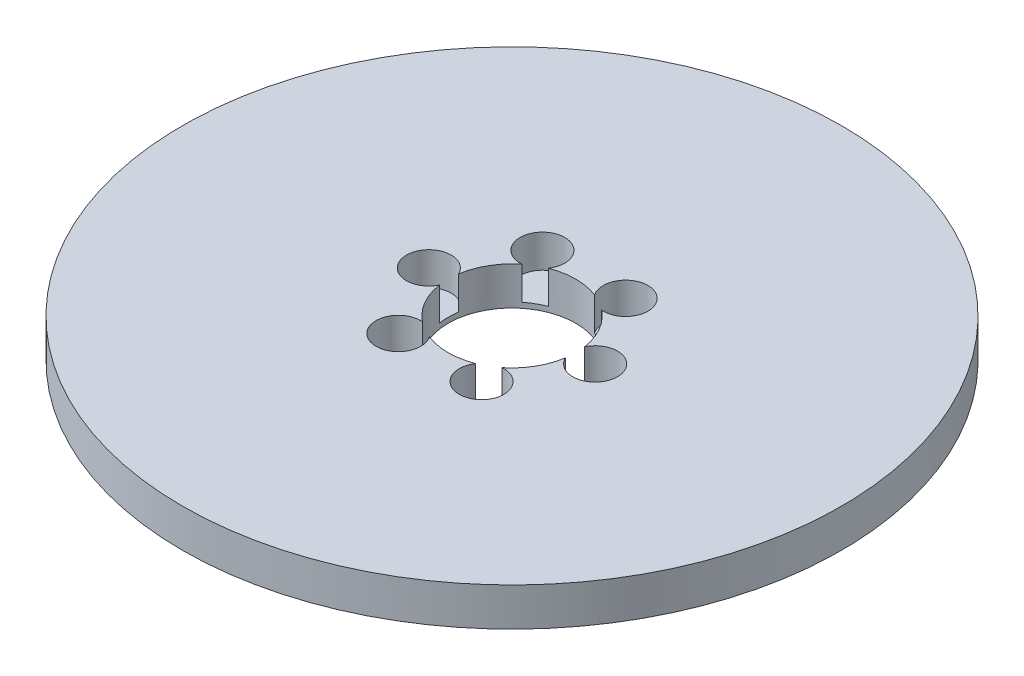
ISO-10303-21;
HEADER;
FILE_DESCRIPTION(('STEP AP214'),'2;1');
FILE_NAME('part.step','',(''),(''),'','','');
FILE_SCHEMA(('AUTOMOTIVE_DESIGN { 1 0 10303 214 1 1 1 1 }'));
ENDSEC;
DATA;
#1=APPLICATION_CONTEXT('core data for automotive mechanical design processes');
#2=APPLICATION_PROTOCOL_DEFINITION('international standard','automotive_design',2000,#1);
#3=PRODUCT_CONTEXT('',#1,'mechanical');
#4=PRODUCT('Part','Part','',(#3));
#5=PRODUCT_RELATED_PRODUCT_CATEGORY('part','',(#4));
#6=PRODUCT_DEFINITION_FORMATION('','',#4);
#7=PRODUCT_DEFINITION_CONTEXT('part definition',#1,'design');
#8=PRODUCT_DEFINITION('design','',#6,#7);
#9=PRODUCT_DEFINITION_SHAPE('','',#8);
#10=(LENGTH_UNIT() NAMED_UNIT(*) SI_UNIT(.MILLI.,.METRE.));
#11=(NAMED_UNIT(*) PLANE_ANGLE_UNIT() SI_UNIT($,.RADIAN.));
#12=(NAMED_UNIT(*) SI_UNIT($,.STERADIAN.) SOLID_ANGLE_UNIT());
#13=UNCERTAINTY_MEASURE_WITH_UNIT(LENGTH_MEASURE(1.E-05),#10,'distance_accuracy_value','');
#14=(GEOMETRIC_REPRESENTATION_CONTEXT(3) GLOBAL_UNCERTAINTY_ASSIGNED_CONTEXT((#13)) GLOBAL_UNIT_ASSIGNED_CONTEXT((#10,
#11,#12)) REPRESENTATION_CONTEXT('',''));
#15=CARTESIAN_POINT('',(0.,0.,0.));
#16=DIRECTION('',(0.,0.,1.));
#17=DIRECTION('',(1.,0.,0.));
#18=AXIS2_PLACEMENT_3D('',#15,#16,#17);
#19=CARTESIAN_POINT('',(0.,9.,0.));
#20=DIRECTION('',(0.,-1.,0.));
#21=DIRECTION('',(0.,0.,-1.));
#22=AXIS2_PLACEMENT_3D('',#19,#20,#21);
#23=CYLINDRICAL_SURFACE('',#22,77.5);
#24=CARTESIAN_POINT('',(0.,9.,0.));
#25=DIRECTION('',(0.,1.,0.));
#26=DIRECTION('',(0.,0.,1.));
#27=AXIS2_PLACEMENT_3D('',#24,#25,#26);
#28=CIRCLE('',#27,77.5);
#29=CARTESIAN_POINT('',(0.,9.,77.5));
#30=VERTEX_POINT('',#29);
#31=EDGE_CURVE('E171',#30,#30,#28,.T.);
#32=ORIENTED_EDGE('',*,*,#31,.F.);
#33=EDGE_LOOP('',(#32));
#34=FACE_BOUND('',#33,.T.);
#35=CARTESIAN_POINT('',(0.,0.,0.));
#36=DIRECTION('',(0.,1.,0.));
#37=DIRECTION('',(0.,0.,1.));
#38=AXIS2_PLACEMENT_3D('',#35,#36,#37);
#39=CIRCLE('',#38,77.5);
#40=CARTESIAN_POINT('',(0.,0.,77.5));
#41=VERTEX_POINT('',#40);
#42=EDGE_CURVE('E157',#41,#41,#39,.T.);
#43=ORIENTED_EDGE('',*,*,#42,.T.);
#44=EDGE_LOOP('',(#43));
#45=FACE_BOUND('',#44,.T.);
#46=ADVANCED_FACE('F39',(#34,#45),#23,.T.);
#47=CARTESIAN_POINT('',(0.,9.,0.));
#48=DIRECTION('',(0.,1.,0.));
#49=DIRECTION('',(0.,0.,1.));
#50=AXIS2_PLACEMENT_3D('',#47,#48,#49);
#51=PLANE('',#50);
#52=CARTESIAN_POINT('',(-9.77904692339867,9.,-16.9378061209262));
#53=DIRECTION('',(0.,1.,0.));
#54=DIRECTION('',(-0.866025403784433,0.,0.50000000000001));
#55=AXIS2_PLACEMENT_3D('',#52,#53,#54);
#56=CIRCLE('',#55,5.24770905868507);
#57=CARTESIAN_POINT('',(-5.44702099483882,9.,-13.9760495949959));
#58=VERTEX_POINT('',#57);
#59=CARTESIAN_POINT('',(-9.38010349639853,9.,-11.7052833539753));
#60=VERTEX_POINT('',#59);
#61=EDGE_CURVE('E214',#58,#60,#56,.T.);
#62=ORIENTED_EDGE('',*,*,#61,.F.);
#63=CARTESIAN_POINT('',(0.,9.,0.));
#64=DIRECTION('',(0.,1.,0.));
#65=DIRECTION('',(0.,0.,1.));
#66=AXIS2_PLACEMENT_3D('',#63,#64,#65);
#67=CIRCLE('',#66,15.);
#68=CARTESIAN_POINT('',(5.44702099483852,9.,-13.976049594996));
#69=VERTEX_POINT('',#68);
#70=EDGE_CURVE('E272',#69,#58,#67,.T.);
#71=ORIENTED_EDGE('',*,*,#70,.F.);
#72=CARTESIAN_POINT('',(9.77904692339832,9.,-16.9378061209264));
#73=DIRECTION('',(0.,1.,0.));
#74=DIRECTION('',(-0.866025403784443,0.,-0.499999999999992));
#75=AXIS2_PLACEMENT_3D('',#72,#73,#74);
#76=CIRCLE('',#75,5.24770905868507);
#77=CARTESIAN_POINT('',(9.38010349639829,9.,-11.7052833539755));
#78=VERTEX_POINT('',#77);
#79=EDGE_CURVE('E285',#78,#69,#76,.T.);
#80=ORIENTED_EDGE('',*,*,#79,.F.);
#81=CARTESIAN_POINT('',(14.827124491237,9.,-2.27076624102052));
#82=VERTEX_POINT('',#81);
#83=EDGE_CURVE('E165',#82,#78,#67,.T.);
#84=ORIENTED_EDGE('',*,*,#83,.F.);
#85=CARTESIAN_POINT('',(19.558093846797,9.,0.));
#86=DIRECTION('',(0.,1.,0.));
#87=DIRECTION('',(0.,0.,-1.));
#88=AXIS2_PLACEMENT_3D('',#85,#86,#87);
#89=CIRCLE('',#88,5.24770905868507);
#90=CARTESIAN_POINT('',(14.827124491237,9.,2.27076624102052));
#91=VERTEX_POINT('',#90);
#92=EDGE_CURVE('E281',#91,#82,#89,.T.);
#93=ORIENTED_EDGE('',*,*,#92,.F.);
#94=CARTESIAN_POINT('',(9.38010349639845,9.,11.7052833539754));
#95=VERTEX_POINT('',#94);
#96=EDGE_CURVE('E160',#95,#91,#67,.T.);
#97=ORIENTED_EDGE('',*,*,#96,.F.);
#98=CARTESIAN_POINT('',(9.77904692339856,9.,16.9378061209262));
#99=DIRECTION('',(0.,1.,0.));
#100=DIRECTION('',(0.866025403784436,0.,-0.500000000000004));
#101=AXIS2_PLACEMENT_3D('',#98,#99,#100);
#102=CIRCLE('',#101,5.24770905868507);
#103=CARTESIAN_POINT('',(5.44702099483872,9.,13.9760495949959));
#104=VERTEX_POINT('',#103);
#105=EDGE_CURVE('E154',#104,#95,#102,.T.);
#106=ORIENTED_EDGE('',*,*,#105,.F.);
#107=CARTESIAN_POINT('',(-5.44702099483862,9.,13.976049594996));
#108=VERTEX_POINT('',#107);
#109=EDGE_CURVE('E150',#108,#104,#67,.T.);
#110=ORIENTED_EDGE('',*,*,#109,.F.);
#111=CARTESIAN_POINT('',(-9.77904692339844,9.,16.9378061209263));
#112=DIRECTION('',(0.,1.,0.));
#113=DIRECTION('',(0.86602540378444,0.,0.499999999999998));
#114=AXIS2_PLACEMENT_3D('',#111,#112,#113);
#115=CIRCLE('',#114,5.24770905868507);
#116=CARTESIAN_POINT('',(-9.38010349639837,9.,11.7052833539755));
#117=VERTEX_POINT('',#116);
#118=EDGE_CURVE('E127',#117,#108,#115,.T.);
#119=ORIENTED_EDGE('',*,*,#118,.F.);
#120=CARTESIAN_POINT('',(-14.827124491237,9.,2.27076624102052));
#121=VERTEX_POINT('',#120);
#122=EDGE_CURVE('E156',#121,#117,#67,.T.);
#123=ORIENTED_EDGE('',*,*,#122,.F.);
#124=CARTESIAN_POINT('',(-19.558093846797,9.,0.));
#125=DIRECTION('',(0.,1.,0.));
#126=DIRECTION('',(0.,0.,1.));
#127=AXIS2_PLACEMENT_3D('',#124,#125,#126);
#128=CIRCLE('',#127,5.24770905868507);
#129=CARTESIAN_POINT('',(-14.827124491237,9.,-2.27076624102052));
#130=VERTEX_POINT('',#129);
#131=EDGE_CURVE('E164',#130,#121,#128,.T.);
#132=ORIENTED_EDGE('',*,*,#131,.F.);
#133=EDGE_CURVE('E159',#60,#130,#67,.T.);
#134=ORIENTED_EDGE('',*,*,#133,.F.);
#135=EDGE_LOOP('',(#62,#71,#80,#84,#93,#97,#106,#110,#119,#123,#132,#134));
#136=FACE_BOUND('',#135,.T.);
#137=ORIENTED_EDGE('',*,*,#31,.T.);
#138=EDGE_LOOP('',(#137));
#139=FACE_BOUND('',#138,.T.);
#140=ADVANCED_FACE('F155',(#136,#139),#51,.T.);
#141=CARTESIAN_POINT('',(0.,0.,0.));
#142=DIRECTION('',(0.,1.,0.));
#143=DIRECTION('',(0.,0.,1.));
#144=AXIS2_PLACEMENT_3D('',#141,#142,#143);
#145=PLANE('',#144);
#146=CARTESIAN_POINT('',(0.,0.,0.));
#147=DIRECTION('',(0.,1.,0.));
#148=DIRECTION('',(0.,0.,1.));
#149=AXIS2_PLACEMENT_3D('',#146,#147,#148);
#150=CIRCLE('',#149,15.);
#151=CARTESIAN_POINT('',(0.,0.,15.));
#152=VERTEX_POINT('',#151);
#153=EDGE_CURVE('E170',#152,#152,#150,.T.);
#154=ORIENTED_EDGE('',*,*,#153,.T.);
#155=EDGE_LOOP('',(#154));
#156=FACE_BOUND('',#155,.T.);
#157=ORIENTED_EDGE('',*,*,#42,.F.);
#158=EDGE_LOOP('',(#157));
#159=FACE_BOUND('',#158,.T.);
#160=ADVANCED_FACE('F232',(#156,#159),#145,.F.);
#161=CARTESIAN_POINT('',(0.,9.,0.));
#162=DIRECTION('',(0.,-1.,0.));
#163=DIRECTION('',(0.,0.,-1.));
#164=AXIS2_PLACEMENT_3D('',#161,#162,#163);
#165=CYLINDRICAL_SURFACE('',#164,15.);
#166=DIRECTION('',(0.,1.,0.));
#167=VECTOR('',#166,1.);
#168=CARTESIAN_POINT('',(-5.44702099483882,5.12002690759225,-13.9760495949959));
#169=LINE('',#168,#167);
#170=CARTESIAN_POINT('',(-5.44702099483882,1.24005381518451,-13.9760495949959));
#171=VERTEX_POINT('',#170);
#172=EDGE_CURVE('E11',#171,#58,#169,.T.);
#173=ORIENTED_EDGE('',*,*,#172,.F.);
#174=CARTESIAN_POINT('',(0.,1.24005381518451,0.));
#175=DIRECTION('',(0.,1.,0.));
#176=DIRECTION('',(0.,0.,1.));
#177=AXIS2_PLACEMENT_3D('',#174,#175,#176);
#178=CIRCLE('',#177,15.);
#179=CARTESIAN_POINT('',(-9.38010349639853,1.24005381518451,-11.7052833539753));
#180=VERTEX_POINT('',#179);
#181=EDGE_CURVE('E209',#171,#180,#178,.T.);
#182=ORIENTED_EDGE('',*,*,#181,.T.);
#183=DIRECTION('',(0.,1.,0.));
#184=VECTOR('',#183,1.);
#185=CARTESIAN_POINT('',(-9.38010349639853,5.12002690759225,-11.7052833539753));
#186=LINE('',#185,#184);
#187=EDGE_CURVE('E46',#60,#180,#186,.F.);
#188=ORIENTED_EDGE('',*,*,#187,.F.);
#189=ORIENTED_EDGE('',*,*,#133,.T.);
#190=DIRECTION('',(0.,1.,0.));
#191=VECTOR('',#190,1.);
#192=CARTESIAN_POINT('',(-14.8271244912371,5.12002690759225,-2.27076624102053));
#193=LINE('',#192,#191);
#194=CARTESIAN_POINT('',(-14.827124491237,1.24005381518451,-2.27076624102052));
#195=VERTEX_POINT('',#194);
#196=EDGE_CURVE('E185',#195,#130,#193,.T.);
#197=ORIENTED_EDGE('',*,*,#196,.F.);
#198=CARTESIAN_POINT('',(0.,1.24005381518451,0.));
#199=DIRECTION('',(0.,1.,0.));
#200=DIRECTION('',(0.,0.,1.));
#201=AXIS2_PLACEMENT_3D('',#198,#199,#200);
#202=CIRCLE('',#201,15.);
#203=CARTESIAN_POINT('',(-14.827124491237,1.24005381518451,2.27076624102052));
#204=VERTEX_POINT('',#203);
#205=EDGE_CURVE('E173',#195,#204,#202,.T.);
#206=ORIENTED_EDGE('',*,*,#205,.T.);
#207=DIRECTION('',(0.,1.,0.));
#208=VECTOR('',#207,1.);
#209=CARTESIAN_POINT('',(-14.8271244912371,5.12002690759225,2.27076624102053));
#210=LINE('',#209,#208);
#211=EDGE_CURVE('E178',#121,#204,#210,.F.);
#212=ORIENTED_EDGE('',*,*,#211,.F.);
#213=ORIENTED_EDGE('',*,*,#122,.T.);
#214=DIRECTION('',(0.,1.,0.));
#215=VECTOR('',#214,1.);
#216=CARTESIAN_POINT('',(-9.38010349639837,5.12002690759225,11.7052833539755));
#217=LINE('',#216,#215);
#218=CARTESIAN_POINT('',(-9.38010349639837,1.24005381518451,11.7052833539755));
#219=VERTEX_POINT('',#218);
#220=EDGE_CURVE('E132',#219,#117,#217,.T.);
#221=ORIENTED_EDGE('',*,*,#220,.F.);
#222=CARTESIAN_POINT('',(0.,1.24005381518451,0.));
#223=DIRECTION('',(0.,1.,0.));
#224=DIRECTION('',(0.,0.,1.));
#225=AXIS2_PLACEMENT_3D('',#222,#223,#224);
#226=CIRCLE('',#225,15.);
#227=CARTESIAN_POINT('',(-5.44702099483862,1.24005381518451,13.976049594996));
#228=VERTEX_POINT('',#227);
#229=EDGE_CURVE('E146',#219,#228,#226,.T.);
#230=ORIENTED_EDGE('',*,*,#229,.T.);
#231=DIRECTION('',(0.,1.,0.));
#232=VECTOR('',#231,1.);
#233=CARTESIAN_POINT('',(-5.44702099483862,5.12002690759225,13.976049594996));
#234=LINE('',#233,#232);
#235=EDGE_CURVE('E128',#108,#228,#234,.F.);
#236=ORIENTED_EDGE('',*,*,#235,.F.);
#237=ORIENTED_EDGE('',*,*,#109,.T.);
#238=DIRECTION('',(0.,1.,0.));
#239=VECTOR('',#238,1.);
#240=CARTESIAN_POINT('',(5.44702099483872,5.12002690759225,13.9760495949959));
#241=LINE('',#240,#239);
#242=CARTESIAN_POINT('',(5.44702099483872,1.24005381518451,13.9760495949959));
#243=VERTEX_POINT('',#242);
#244=EDGE_CURVE('E192',#243,#104,#241,.T.);
#245=ORIENTED_EDGE('',*,*,#244,.F.);
#246=CARTESIAN_POINT('',(0.,1.24005381518451,0.));
#247=DIRECTION('',(0.,1.,0.));
#248=DIRECTION('',(0.,0.,1.));
#249=AXIS2_PLACEMENT_3D('',#246,#247,#248);
#250=CIRCLE('',#249,15.);
#251=CARTESIAN_POINT('',(9.38010349639845,1.24005381518451,11.7052833539754));
#252=VERTEX_POINT('',#251);
#253=EDGE_CURVE('E190',#243,#252,#250,.T.);
#254=ORIENTED_EDGE('',*,*,#253,.T.);
#255=DIRECTION('',(0.,1.,0.));
#256=VECTOR('',#255,1.);
#257=CARTESIAN_POINT('',(9.38010349639844,5.12002690759225,11.7052833539754));
#258=LINE('',#257,#256);
#259=EDGE_CURVE('E189',#95,#252,#258,.F.);
#260=ORIENTED_EDGE('',*,*,#259,.F.);
#261=ORIENTED_EDGE('',*,*,#96,.T.);
#262=DIRECTION('',(0.,1.,0.));
#263=VECTOR('',#262,1.);
#264=CARTESIAN_POINT('',(14.8271244912371,5.12002690759225,2.27076624102053));
#265=LINE('',#264,#263);
#266=CARTESIAN_POINT('',(14.827124491237,1.24005381518451,2.27076624102052));
#267=VERTEX_POINT('',#266);
#268=EDGE_CURVE('E203',#267,#91,#265,.T.);
#269=ORIENTED_EDGE('',*,*,#268,.F.);
#270=CARTESIAN_POINT('',(0.,1.24005381518451,0.));
#271=DIRECTION('',(0.,1.,0.));
#272=DIRECTION('',(0.,0.,1.));
#273=AXIS2_PLACEMENT_3D('',#270,#271,#272);
#274=CIRCLE('',#273,15.);
#275=CARTESIAN_POINT('',(14.827124491237,1.24005381518451,-2.27076624102052));
#276=VERTEX_POINT('',#275);
#277=EDGE_CURVE('E194',#267,#276,#274,.T.);
#278=ORIENTED_EDGE('',*,*,#277,.T.);
#279=DIRECTION('',(0.,1.,0.));
#280=VECTOR('',#279,1.);
#281=CARTESIAN_POINT('',(14.8271244912371,5.12002690759225,-2.27076624102053));
#282=LINE('',#281,#280);
#283=EDGE_CURVE('E196',#82,#276,#282,.F.);
#284=ORIENTED_EDGE('',*,*,#283,.F.);
#285=ORIENTED_EDGE('',*,*,#83,.T.);
#286=DIRECTION('',(0.,1.,0.));
#287=VECTOR('',#286,1.);
#288=CARTESIAN_POINT('',(9.38010349639829,5.12002690759225,-11.7052833539755));
#289=LINE('',#288,#287);
#290=CARTESIAN_POINT('',(9.38010349639829,1.24005381518451,-11.7052833539755));
#291=VERTEX_POINT('',#290);
#292=EDGE_CURVE('E208',#291,#78,#289,.T.);
#293=ORIENTED_EDGE('',*,*,#292,.F.);
#294=CARTESIAN_POINT('',(0.,1.24005381518451,0.));
#295=DIRECTION('',(0.,1.,0.));
#296=DIRECTION('',(0.,0.,1.));
#297=AXIS2_PLACEMENT_3D('',#294,#295,#296);
#298=CIRCLE('',#297,15.);
#299=CARTESIAN_POINT('',(5.44702099483852,1.24005381518451,-13.976049594996));
#300=VERTEX_POINT('',#299);
#301=EDGE_CURVE('E201',#291,#300,#298,.T.);
#302=ORIENTED_EDGE('',*,*,#301,.T.);
#303=DIRECTION('',(0.,1.,0.));
#304=VECTOR('',#303,1.);
#305=CARTESIAN_POINT('',(5.44702099483852,5.12002690759225,-13.976049594996));
#306=LINE('',#305,#304);
#307=EDGE_CURVE('E206',#69,#300,#306,.F.);
#308=ORIENTED_EDGE('',*,*,#307,.F.);
#309=ORIENTED_EDGE('',*,*,#70,.T.);
#310=EDGE_LOOP('',(#173,#182,#188,#189,#197,#206,#212,#213,#221,#230,#236,#237,#245,#254,#260,
#261,#269,#278,#284,#285,#293,#302,#308,#309));
#311=FACE_BOUND('',#310,.T.);
#312=ORIENTED_EDGE('',*,*,#153,.F.);
#313=EDGE_LOOP('',(#312));
#314=FACE_BOUND('',#313,.T.);
#315=ADVANCED_FACE('F145',(#311,#314),#165,.F.);
#316=CARTESIAN_POINT('',(-19.558093846797,1.24005381518451,0.));
#317=DIRECTION('',(0.,1.,0.));
#318=DIRECTION('',(0.,0.,1.));
#319=AXIS2_PLACEMENT_3D('',#316,#317,#318);
#320=CYLINDRICAL_SURFACE('',#319,5.24770905868507);
#321=ORIENTED_EDGE('',*,*,#196,.T.);
#322=ORIENTED_EDGE('',*,*,#131,.T.);
#323=ORIENTED_EDGE('',*,*,#211,.T.);
#324=CARTESIAN_POINT('',(-19.558093846797,1.24005381518451,0.));
#325=DIRECTION('',(0.,1.,0.));
#326=DIRECTION('',(0.,0.,1.));
#327=AXIS2_PLACEMENT_3D('',#324,#325,#326);
#328=CIRCLE('',#327,5.24770905868507);
#329=EDGE_CURVE('E168',#195,#204,#328,.T.);
#330=ORIENTED_EDGE('',*,*,#329,.F.);
#331=EDGE_LOOP('',(#321,#322,#323,#330));
#332=FACE_BOUND('',#331,.T.);
#333=ADVANCED_FACE('F243',(#332),#320,.F.);
#334=CARTESIAN_POINT('',(-19.558093846797,1.24005381518451,0.));
#335=DIRECTION('',(0.,1.,0.));
#336=DIRECTION('',(0.,0.,1.));
#337=AXIS2_PLACEMENT_3D('',#334,#335,#336);
#338=PLANE('',#337);
#339=ORIENTED_EDGE('',*,*,#329,.T.);
#340=ORIENTED_EDGE('',*,*,#205,.F.);
#341=EDGE_LOOP('',(#339,#340));
#342=FACE_BOUND('',#341,.T.);
#343=ADVANCED_FACE('F247',(#342),#338,.T.);
#344=CARTESIAN_POINT('',(-9.77904692339844,1.24005381518451,16.9378061209263));
#345=DIRECTION('',(0.,1.,0.));
#346=DIRECTION('',(0.,0.,1.));
#347=AXIS2_PLACEMENT_3D('',#344,#345,#346);
#348=CYLINDRICAL_SURFACE('',#347,5.24770905868507);
#349=ORIENTED_EDGE('',*,*,#220,.T.);
#350=ORIENTED_EDGE('',*,*,#118,.T.);
#351=ORIENTED_EDGE('',*,*,#235,.T.);
#352=CARTESIAN_POINT('',(-9.77904692339844,1.24005381518451,16.9378061209263));
#353=DIRECTION('',(0.,1.,0.));
#354=DIRECTION('',(0.86602540378444,0.,0.499999999999998));
#355=AXIS2_PLACEMENT_3D('',#352,#353,#354);
#356=CIRCLE('',#355,5.24770905868507);
#357=EDGE_CURVE('E137',#219,#228,#356,.T.);
#358=ORIENTED_EDGE('',*,*,#357,.F.);
#359=EDGE_LOOP('',(#349,#350,#351,#358));
#360=FACE_BOUND('',#359,.T.);
#361=ADVANCED_FACE('F126',(#360),#348,.F.);
#362=CARTESIAN_POINT('',(-9.77904692339844,1.24005381518451,16.9378061209263));
#363=DIRECTION('',(0.,1.,0.));
#364=DIRECTION('',(0.86602540378444,0.,0.499999999999998));
#365=AXIS2_PLACEMENT_3D('',#362,#363,#364);
#366=PLANE('',#365);
#367=ORIENTED_EDGE('',*,*,#357,.T.);
#368=ORIENTED_EDGE('',*,*,#229,.F.);
#369=EDGE_LOOP('',(#367,#368));
#370=FACE_BOUND('',#369,.T.);
#371=ADVANCED_FACE('F254',(#370),#366,.T.);
#372=CARTESIAN_POINT('',(9.77904692339856,1.24005381518451,16.9378061209262));
#373=DIRECTION('',(0.,1.,0.));
#374=DIRECTION('',(0.,0.,1.));
#375=AXIS2_PLACEMENT_3D('',#372,#373,#374);
#376=CYLINDRICAL_SURFACE('',#375,5.24770905868507);
#377=ORIENTED_EDGE('',*,*,#244,.T.);
#378=ORIENTED_EDGE('',*,*,#105,.T.);
#379=ORIENTED_EDGE('',*,*,#259,.T.);
#380=CARTESIAN_POINT('',(9.77904692339856,1.24005381518451,16.9378061209262));
#381=DIRECTION('',(0.,1.,0.));
#382=DIRECTION('',(0.866025403784436,0.,-0.500000000000004));
#383=AXIS2_PLACEMENT_3D('',#380,#381,#382);
#384=CIRCLE('',#383,5.24770905868507);
#385=EDGE_CURVE('E138',#243,#252,#384,.T.);
#386=ORIENTED_EDGE('',*,*,#385,.F.);
#387=EDGE_LOOP('',(#377,#378,#379,#386));
#388=FACE_BOUND('',#387,.T.);
#389=ADVANCED_FACE('F260',(#388),#376,.F.);
#390=CARTESIAN_POINT('',(9.77904692339856,1.24005381518451,16.9378061209262));
#391=DIRECTION('',(0.,1.,0.));
#392=DIRECTION('',(0.866025403784436,0.,-0.500000000000004));
#393=AXIS2_PLACEMENT_3D('',#390,#391,#392);
#394=PLANE('',#393);
#395=ORIENTED_EDGE('',*,*,#385,.T.);
#396=ORIENTED_EDGE('',*,*,#253,.F.);
#397=EDGE_LOOP('',(#395,#396));
#398=FACE_BOUND('',#397,.T.);
#399=ADVANCED_FACE('F265',(#398),#394,.T.);
#400=CARTESIAN_POINT('',(19.558093846797,1.24005381518451,0.));
#401=DIRECTION('',(0.,1.,0.));
#402=DIRECTION('',(0.,0.,1.));
#403=AXIS2_PLACEMENT_3D('',#400,#401,#402);
#404=CYLINDRICAL_SURFACE('',#403,5.24770905868507);
#405=ORIENTED_EDGE('',*,*,#268,.T.);
#406=ORIENTED_EDGE('',*,*,#92,.T.);
#407=ORIENTED_EDGE('',*,*,#283,.T.);
#408=CARTESIAN_POINT('',(19.558093846797,1.24005381518451,0.));
#409=DIRECTION('',(0.,1.,0.));
#410=DIRECTION('',(0.,0.,-1.));
#411=AXIS2_PLACEMENT_3D('',#408,#409,#410);
#412=CIRCLE('',#411,5.24770905868507);
#413=EDGE_CURVE('E287',#267,#276,#412,.T.);
#414=ORIENTED_EDGE('',*,*,#413,.F.);
#415=EDGE_LOOP('',(#405,#406,#407,#414));
#416=FACE_BOUND('',#415,.T.);
#417=ADVANCED_FACE('F300',(#416),#404,.F.);
#418=CARTESIAN_POINT('',(19.558093846797,1.24005381518451,0.));
#419=DIRECTION('',(0.,1.,0.));
#420=DIRECTION('',(0.,0.,-1.));
#421=AXIS2_PLACEMENT_3D('',#418,#419,#420);
#422=PLANE('',#421);
#423=ORIENTED_EDGE('',*,*,#413,.T.);
#424=ORIENTED_EDGE('',*,*,#277,.F.);
#425=EDGE_LOOP('',(#423,#424));
#426=FACE_BOUND('',#425,.T.);
#427=ADVANCED_FACE('F298',(#426),#422,.T.);
#428=CARTESIAN_POINT('',(9.77904692339832,1.24005381518451,-16.9378061209264));
#429=DIRECTION('',(0.,1.,0.));
#430=DIRECTION('',(0.,0.,1.));
#431=AXIS2_PLACEMENT_3D('',#428,#429,#430);
#432=CYLINDRICAL_SURFACE('',#431,5.24770905868507);
#433=ORIENTED_EDGE('',*,*,#292,.T.);
#434=ORIENTED_EDGE('',*,*,#79,.T.);
#435=ORIENTED_EDGE('',*,*,#307,.T.);
#436=CARTESIAN_POINT('',(9.77904692339832,1.24005381518451,-16.9378061209264));
#437=DIRECTION('',(0.,1.,0.));
#438=DIRECTION('',(-0.866025403784443,0.,-0.499999999999992));
#439=AXIS2_PLACEMENT_3D('',#436,#437,#438);
#440=CIRCLE('',#439,5.24770905868507);
#441=EDGE_CURVE('E56',#291,#300,#440,.T.);
#442=ORIENTED_EDGE('',*,*,#441,.F.);
#443=EDGE_LOOP('',(#433,#434,#435,#442));
#444=FACE_BOUND('',#443,.T.);
#445=ADVANCED_FACE('F301',(#444),#432,.F.);
#446=CARTESIAN_POINT('',(9.77904692339832,1.24005381518451,-16.9378061209264));
#447=DIRECTION('',(0.,1.,0.));
#448=DIRECTION('',(-0.866025403784443,0.,-0.499999999999992));
#449=AXIS2_PLACEMENT_3D('',#446,#447,#448);
#450=PLANE('',#449);
#451=ORIENTED_EDGE('',*,*,#441,.T.);
#452=ORIENTED_EDGE('',*,*,#301,.F.);
#453=EDGE_LOOP('',(#451,#452));
#454=FACE_BOUND('',#453,.T.);
#455=ADVANCED_FACE('F221',(#454),#450,.T.);
#456=CARTESIAN_POINT('',(-9.77904692339867,1.24005381518451,-16.9378061209262));
#457=DIRECTION('',(0.,1.,0.));
#458=DIRECTION('',(0.,0.,1.));
#459=AXIS2_PLACEMENT_3D('',#456,#457,#458);
#460=CYLINDRICAL_SURFACE('',#459,5.24770905868507);
#461=ORIENTED_EDGE('',*,*,#172,.T.);
#462=ORIENTED_EDGE('',*,*,#61,.T.);
#463=ORIENTED_EDGE('',*,*,#187,.T.);
#464=CARTESIAN_POINT('',(-9.77904692339867,1.24005381518451,-16.9378061209262));
#465=DIRECTION('',(0.,1.,0.));
#466=DIRECTION('',(-0.866025403784433,0.,0.50000000000001));
#467=AXIS2_PLACEMENT_3D('',#464,#465,#466);
#468=CIRCLE('',#467,5.24770905868507);
#469=EDGE_CURVE('E55',#171,#180,#468,.T.);
#470=ORIENTED_EDGE('',*,*,#469,.F.);
#471=EDGE_LOOP('',(#461,#462,#463,#470));
#472=FACE_BOUND('',#471,.T.);
#473=ADVANCED_FACE('F212',(#472),#460,.F.);
#474=CARTESIAN_POINT('',(-9.77904692339867,1.24005381518451,-16.9378061209262));
#475=DIRECTION('',(0.,1.,0.));
#476=DIRECTION('',(-0.866025403784433,0.,0.50000000000001));
#477=AXIS2_PLACEMENT_3D('',#474,#475,#476);
#478=PLANE('',#477);
#479=ORIENTED_EDGE('',*,*,#469,.T.);
#480=ORIENTED_EDGE('',*,*,#181,.F.);
#481=EDGE_LOOP('',(#479,#480));
#482=FACE_BOUND('',#481,.T.);
#483=ADVANCED_FACE('F217',(#482),#478,.T.);
#484=CLOSED_SHELL('',(#46,#140,#160,#315,#333,#343,#361,#371,#389,#399,#417,#427,#445,#455,#473,#483));
#485=MANIFOLD_SOLID_BREP('B2',#484);
#486=ADVANCED_BREP_SHAPE_REPRESENTATION('',(#18,#485),#14);
#487=SHAPE_DEFINITION_REPRESENTATION(#9,#486);
ENDSEC;
END-ISO-10303-21;
